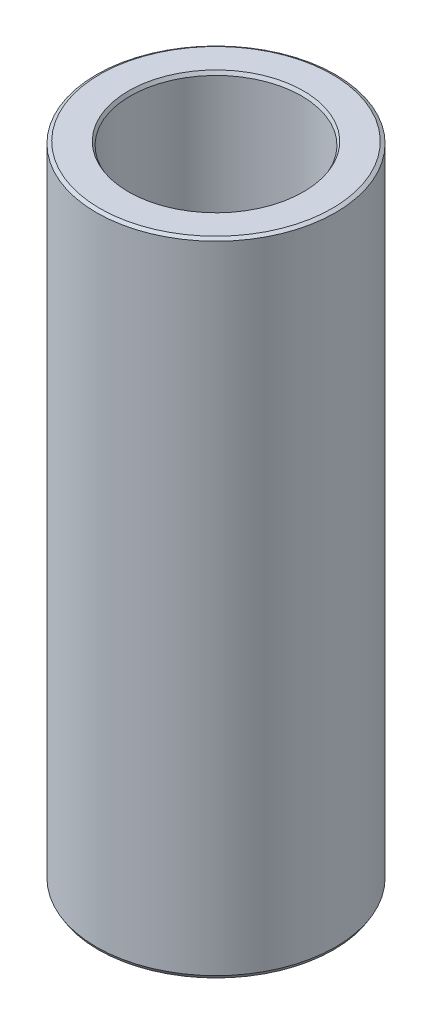
ISO-10303-21;
HEADER;
FILE_DESCRIPTION(('STEP AP214'),'2;1');
FILE_NAME('part.step','',(''),(''),'','','');
FILE_SCHEMA(('AUTOMOTIVE_DESIGN { 1 0 10303 214 1 1 1 1 }'));
ENDSEC;
DATA;
#1=APPLICATION_CONTEXT('core data for automotive mechanical design processes');
#2=APPLICATION_PROTOCOL_DEFINITION('international standard','automotive_design',2000,#1);
#3=PRODUCT_CONTEXT('',#1,'mechanical');
#4=PRODUCT('Part','Part','',(#3));
#5=PRODUCT_RELATED_PRODUCT_CATEGORY('part','',(#4));
#6=PRODUCT_DEFINITION_FORMATION('','',#4);
#7=PRODUCT_DEFINITION_CONTEXT('part definition',#1,'design');
#8=PRODUCT_DEFINITION('design','',#6,#7);
#9=PRODUCT_DEFINITION_SHAPE('','',#8);
#10=(LENGTH_UNIT() NAMED_UNIT(*) SI_UNIT(.MILLI.,.METRE.));
#11=(NAMED_UNIT(*) PLANE_ANGLE_UNIT() SI_UNIT($,.RADIAN.));
#12=(NAMED_UNIT(*) SI_UNIT($,.STERADIAN.) SOLID_ANGLE_UNIT());
#13=UNCERTAINTY_MEASURE_WITH_UNIT(LENGTH_MEASURE(1.E-05),#10,'distance_accuracy_value','');
#14=(GEOMETRIC_REPRESENTATION_CONTEXT(3) GLOBAL_UNCERTAINTY_ASSIGNED_CONTEXT((#13)) GLOBAL_UNIT_ASSIGNED_CONTEXT((#10,
#11,#12)) REPRESENTATION_CONTEXT('',''));
#15=CARTESIAN_POINT('',(0.,0.,0.));
#16=DIRECTION('',(0.,0.,1.));
#17=DIRECTION('',(1.,0.,0.));
#18=AXIS2_PLACEMENT_3D('',#15,#16,#17);
#19=CARTESIAN_POINT('',(0.,174.338042168306,0.));
#20=DIRECTION('',(0.,-1.,0.));
#21=DIRECTION('',(0.,0.,-1.));
#22=AXIS2_PLACEMENT_3D('',#19,#20,#21);
#23=CYLINDRICAL_SURFACE('',#22,32.5);
#24=CARTESIAN_POINT('',(0.,0.919868104000743,0.));
#25=DIRECTION('',(0.,1.,0.));
#26=DIRECTION('',(0.,0.,1.));
#27=AXIS2_PLACEMENT_3D('',#24,#25,#26);
#28=CIRCLE('',#27,32.5);
#29=CARTESIAN_POINT('',(0.,0.919868104000743,32.5));
#30=VERTEX_POINT('',#29);
#31=EDGE_CURVE('E10',#30,#30,#28,.T.);
#32=ORIENTED_EDGE('',*,*,#31,.T.);
#33=EDGE_LOOP('',(#32));
#34=FACE_BOUND('',#33,.T.);
#35=CARTESIAN_POINT('',(0.,173.806956070842,0.));
#36=DIRECTION('',(0.,1.,0.));
#37=DIRECTION('',(0.,0.,1.));
#38=AXIS2_PLACEMENT_3D('',#35,#36,#37);
#39=CIRCLE('',#38,32.5);
#40=CARTESIAN_POINT('',(0.,173.806956070842,32.5));
#41=VERTEX_POINT('',#40);
#42=EDGE_CURVE('E50',#41,#41,#39,.F.);
#43=ORIENTED_EDGE('',*,*,#42,.T.);
#44=EDGE_LOOP('',(#43));
#45=FACE_BOUND('',#44,.T.);
#46=ADVANCED_FACE('F39',(#34,#45),#23,.T.);
#47=CARTESIAN_POINT('',(0.,174.338042168306,0.));
#48=DIRECTION('',(0.,1.,0.));
#49=DIRECTION('',(0.,0.,1.));
#50=AXIS2_PLACEMENT_3D('',#47,#48,#49);
#51=PLANE('',#50);
#52=CARTESIAN_POINT('',(0.,174.338042168306,0.));
#53=DIRECTION('',(0.,1.,0.));
#54=DIRECTION('',(0.,0.,1.));
#55=AXIS2_PLACEMENT_3D('',#52,#53,#54);
#56=CIRCLE('',#55,23.7878503961865);
#57=CARTESIAN_POINT('',(0.,174.338042168306,23.7878503961865));
#58=VERTEX_POINT('',#57);
#59=EDGE_CURVE('E58',#58,#58,#56,.F.);
#60=ORIENTED_EDGE('',*,*,#59,.T.);
#61=EDGE_LOOP('',(#60));
#62=FACE_BOUND('',#61,.T.);
#63=CARTESIAN_POINT('',(0.,174.338042168306,0.));
#64=DIRECTION('',(0.,1.,0.));
#65=DIRECTION('',(0.,0.,1.));
#66=AXIS2_PLACEMENT_3D('',#63,#64,#65);
#67=CIRCLE('',#66,31.5801318959993);
#68=CARTESIAN_POINT('',(0.,174.338042168306,31.5801318959993));
#69=VERTEX_POINT('',#68);
#70=EDGE_CURVE('E61',#69,#69,#67,.T.);
#71=ORIENTED_EDGE('',*,*,#70,.T.);
#72=EDGE_LOOP('',(#71));
#73=FACE_BOUND('',#72,.T.);
#74=ADVANCED_FACE('F88',(#62,#73),#51,.T.);
#75=CARTESIAN_POINT('',(0.,0.,0.));
#76=DIRECTION('',(0.,1.,0.));
#77=DIRECTION('',(0.,0.,1.));
#78=AXIS2_PLACEMENT_3D('',#75,#76,#77);
#79=PLANE('',#78);
#80=CARTESIAN_POINT('',(0.,0.,0.));
#81=DIRECTION('',(0.,1.,0.));
#82=DIRECTION('',(0.,0.,1.));
#83=AXIS2_PLACEMENT_3D('',#80,#81,#82);
#84=CIRCLE('',#83,24.1766324027235);
#85=CARTESIAN_POINT('',(0.,0.,24.1766324027235));
#86=VERTEX_POINT('',#85);
#87=EDGE_CURVE('E51',#86,#86,#84,.T.);
#88=ORIENTED_EDGE('',*,*,#87,.T.);
#89=EDGE_LOOP('',(#88));
#90=FACE_BOUND('',#89,.T.);
#91=CARTESIAN_POINT('',(0.,0.,0.));
#92=DIRECTION('',(0.,1.,0.));
#93=DIRECTION('',(0.,0.,1.));
#94=AXIS2_PLACEMENT_3D('',#91,#92,#93);
#95=CIRCLE('',#94,31.9689139025362);
#96=CARTESIAN_POINT('',(0.,0.,31.9689139025362));
#97=VERTEX_POINT('',#96);
#98=EDGE_CURVE('E54',#97,#97,#95,.F.);
#99=ORIENTED_EDGE('',*,*,#98,.T.);
#100=EDGE_LOOP('',(#99));
#101=FACE_BOUND('',#100,.T.);
#102=ADVANCED_FACE('F83',(#90,#101),#79,.F.);
#103=CARTESIAN_POINT('',(0.,174.338042168306,0.));
#104=DIRECTION('',(0.,-1.,0.));
#105=DIRECTION('',(0.,0.,-1.));
#106=AXIS2_PLACEMENT_3D('',#103,#104,#105);
#107=CYLINDRICAL_SURFACE('',#106,23.2567642987227);
#108=CARTESIAN_POINT('',(0.,173.418174064305,0.));
#109=DIRECTION('',(0.,1.,0.));
#110=DIRECTION('',(0.,0.,1.));
#111=AXIS2_PLACEMENT_3D('',#108,#109,#110);
#112=CIRCLE('',#111,23.2567642987227);
#113=CARTESIAN_POINT('',(0.,173.418174064305,23.2567642987227));
#114=VERTEX_POINT('',#113);
#115=EDGE_CURVE('E67',#114,#114,#112,.T.);
#116=ORIENTED_EDGE('',*,*,#115,.T.);
#117=EDGE_LOOP('',(#116));
#118=FACE_BOUND('',#117,.T.);
#119=CARTESIAN_POINT('',(0.,0.531086097463773,0.));
#120=DIRECTION('',(0.,1.,0.));
#121=DIRECTION('',(0.,0.,1.));
#122=AXIS2_PLACEMENT_3D('',#119,#120,#121);
#123=CIRCLE('',#122,23.2567642987227);
#124=CARTESIAN_POINT('',(0.,0.531086097463773,23.2567642987227));
#125=VERTEX_POINT('',#124);
#126=EDGE_CURVE('E69',#125,#125,#123,.F.);
#127=ORIENTED_EDGE('',*,*,#126,.T.);
#128=EDGE_LOOP('',(#127));
#129=FACE_BOUND('',#128,.T.);
#130=ADVANCED_FACE('F71',(#118,#129),#107,.F.);
#131=CARTESIAN_POINT('',(0.,173.418174064305,0.));
#132=DIRECTION('',(0.,1.,0.));
#133=DIRECTION('',(0.,0.,1.));
#134=AXIS2_PLACEMENT_3D('',#131,#132,#133);
#135=CONICAL_SURFACE('',#134,23.2567642987227,0.523598775598293);
#136=ORIENTED_EDGE('',*,*,#59,.F.);
#137=EDGE_LOOP('',(#136));
#138=FACE_BOUND('',#137,.T.);
#139=ORIENTED_EDGE('',*,*,#115,.F.);
#140=EDGE_LOOP('',(#139));
#141=FACE_BOUND('',#140,.T.);
#142=ADVANCED_FACE('F77',(#138,#141),#135,.F.);
#143=CARTESIAN_POINT('',(0.,0.,0.));
#144=DIRECTION('',(0.,-1.,0.));
#145=DIRECTION('',(0.,0.,-1.));
#146=AXIS2_PLACEMENT_3D('',#143,#144,#145);
#147=CONICAL_SURFACE('',#146,24.1766324027235,1.0471975511966);
#148=ORIENTED_EDGE('',*,*,#126,.F.);
#149=EDGE_LOOP('',(#148));
#150=FACE_BOUND('',#149,.T.);
#151=ORIENTED_EDGE('',*,*,#87,.F.);
#152=EDGE_LOOP('',(#151));
#153=FACE_BOUND('',#152,.T.);
#154=ADVANCED_FACE('F73',(#150,#153),#147,.F.);
#155=CARTESIAN_POINT('',(0.,0.919868104000743,0.));
#156=DIRECTION('',(0.,1.,0.));
#157=DIRECTION('',(0.,0.,1.));
#158=AXIS2_PLACEMENT_3D('',#155,#156,#157);
#159=CONICAL_SURFACE('',#158,32.5,0.523598775598305);
#160=ORIENTED_EDGE('',*,*,#98,.F.);
#161=EDGE_LOOP('',(#160));
#162=FACE_BOUND('',#161,.T.);
#163=ORIENTED_EDGE('',*,*,#31,.F.);
#164=EDGE_LOOP('',(#163));
#165=FACE_BOUND('',#164,.T.);
#166=ADVANCED_FACE('F76',(#162,#165),#159,.T.);
#167=CARTESIAN_POINT('',(0.,174.338042168306,0.));
#168=DIRECTION('',(0.,-1.,0.));
#169=DIRECTION('',(0.,0.,-1.));
#170=AXIS2_PLACEMENT_3D('',#167,#168,#169);
#171=CONICAL_SURFACE('',#170,31.5801318959993,1.04719755119659);
#172=ORIENTED_EDGE('',*,*,#42,.F.);
#173=EDGE_LOOP('',(#172));
#174=FACE_BOUND('',#173,.T.);
#175=ORIENTED_EDGE('',*,*,#70,.F.);
#176=EDGE_LOOP('',(#175));
#177=FACE_BOUND('',#176,.T.);
#178=ADVANCED_FACE('F45',(#174,#177),#171,.T.);
#179=CLOSED_SHELL('',(#46,#74,#102,#130,#142,#154,#166,#178));
#180=MANIFOLD_SOLID_BREP('B2',#179);
#181=ADVANCED_BREP_SHAPE_REPRESENTATION('',(#18,#180),#14);
#182=SHAPE_DEFINITION_REPRESENTATION(#9,#181);
ENDSEC;
END-ISO-10303-21;
